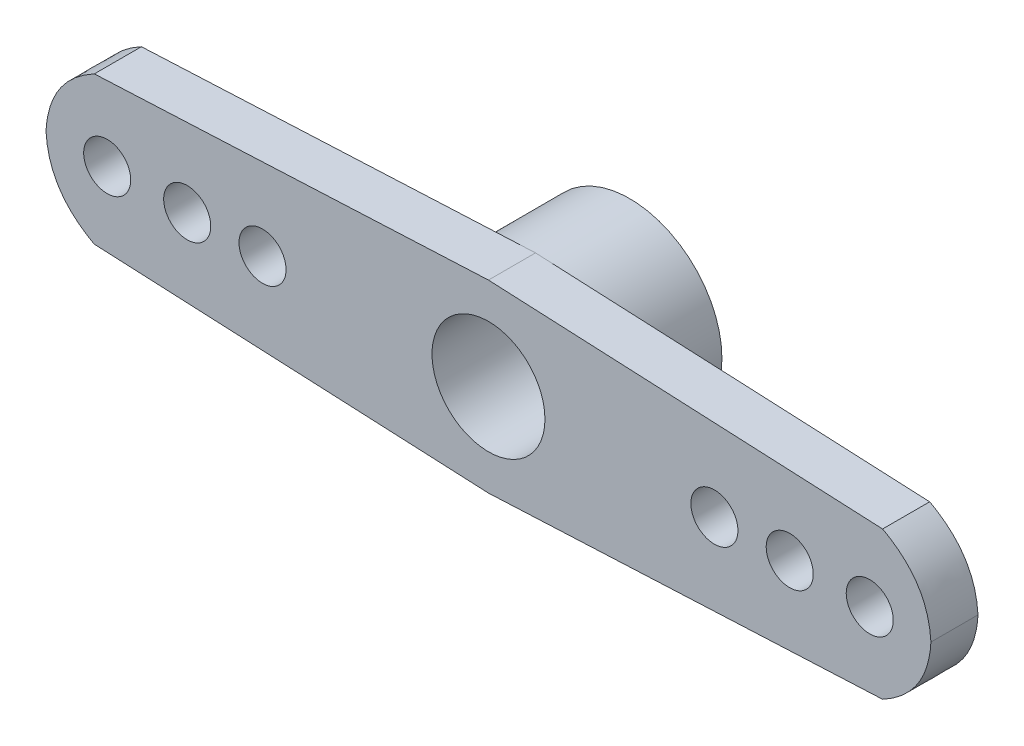
ISO-10303-21;
HEADER;
FILE_DESCRIPTION(('STEP AP214'),'2;1');
FILE_NAME('part.step','',(''),(''),'','','');
FILE_SCHEMA(('AUTOMOTIVE_DESIGN { 1 0 10303 214 1 1 1 1 }'));
ENDSEC;
DATA;
#1=APPLICATION_CONTEXT('core data for automotive mechanical design processes');
#2=APPLICATION_PROTOCOL_DEFINITION('international standard','automotive_design',2000,#1);
#3=PRODUCT_CONTEXT('',#1,'mechanical');
#4=PRODUCT('Part','Part','',(#3));
#5=PRODUCT_RELATED_PRODUCT_CATEGORY('part','',(#4));
#6=PRODUCT_DEFINITION_FORMATION('','',#4);
#7=PRODUCT_DEFINITION_CONTEXT('part definition',#1,'design');
#8=PRODUCT_DEFINITION('design','',#6,#7);
#9=PRODUCT_DEFINITION_SHAPE('','',#8);
#10=(LENGTH_UNIT() NAMED_UNIT(*) SI_UNIT(.MILLI.,.METRE.));
#11=(NAMED_UNIT(*) PLANE_ANGLE_UNIT() SI_UNIT($,.RADIAN.));
#12=(NAMED_UNIT(*) SI_UNIT($,.STERADIAN.) SOLID_ANGLE_UNIT());
#13=UNCERTAINTY_MEASURE_WITH_UNIT(LENGTH_MEASURE(1.E-05),#10,'distance_accuracy_value','');
#14=(GEOMETRIC_REPRESENTATION_CONTEXT(3) GLOBAL_UNCERTAINTY_ASSIGNED_CONTEXT((#13)) GLOBAL_UNIT_ASSIGNED_CONTEXT((#10,
#11,#12)) REPRESENTATION_CONTEXT('',''));
#15=CARTESIAN_POINT('',(0.,0.,0.));
#16=DIRECTION('',(0.,0.,1.));
#17=DIRECTION('',(1.,0.,0.));
#18=AXIS2_PLACEMENT_3D('',#15,#16,#17);
#19=CARTESIAN_POINT('',(0.,0.,5.));
#20=DIRECTION('',(0.,0.,-1.));
#21=DIRECTION('',(-1.,0.,0.));
#22=AXIS2_PLACEMENT_3D('',#19,#20,#21);
#23=CYLINDRICAL_SURFACE('',#22,4.9);
#24=CARTESIAN_POINT('',(0.45908660855378,4.87844642133606,5.));
#25=DIRECTION('',(-0.998899722313693,0.0468971722135448,0.));
#26=VECTOR('',#25,1.);
#27=LINE('',#24,#26);
#28=CARTESIAN_POINT('',(0.45908660855378,4.87844642133606,5.));
#29=VERTEX_POINT('',#28);
#30=CARTESIAN_POINT('',(0.,4.9,5.));
#31=VERTEX_POINT('',#30);
#32=EDGE_CURVE('E13',#29,#31,#27,.T.);
#33=ORIENTED_EDGE('',*,*,#32,.F.);
#34=CARTESIAN_POINT('',(0.,0.,5.));
#35=DIRECTION('',(0.,0.,1.));
#36=DIRECTION('',(1.,0.,0.));
#37=AXIS2_PLACEMENT_3D('',#34,#35,#36);
#38=CIRCLE('',#37,4.9);
#39=CARTESIAN_POINT('',(0.45908660855378,-4.87844642133606,5.));
#40=VERTEX_POINT('',#39);
#41=EDGE_CURVE('E63',#40,#29,#38,.T.);
#42=ORIENTED_EDGE('',*,*,#41,.F.);
#43=CARTESIAN_POINT('',(0.,-4.9,5.));
#44=DIRECTION('',(0.998899722313693,0.0468971722135448,0.));
#45=VECTOR('',#44,1.);
#46=LINE('',#43,#45);
#47=CARTESIAN_POINT('',(0.,-4.9,5.));
#48=VERTEX_POINT('',#47);
#49=EDGE_CURVE('E369',#48,#40,#46,.T.);
#50=ORIENTED_EDGE('',*,*,#49,.F.);
#51=CARTESIAN_POINT('',(-0.45908660855378,-4.87844642133606,5.));
#52=DIRECTION('',(0.998899722313693,-0.0468971722135448,0.));
#53=VECTOR('',#52,1.);
#54=LINE('',#51,#53);
#55=CARTESIAN_POINT('',(-0.45908660855378,-4.87844642133606,5.));
#56=VERTEX_POINT('',#55);
#57=EDGE_CURVE('E56',#56,#48,#54,.T.);
#58=ORIENTED_EDGE('',*,*,#57,.F.);
#59=CARTESIAN_POINT('',(-0.45908660855378,4.87844642133606,5.));
#60=VERTEX_POINT('',#59);
#61=EDGE_CURVE('E270',#60,#56,#38,.T.);
#62=ORIENTED_EDGE('',*,*,#61,.F.);
#63=CARTESIAN_POINT('',(0.,4.9,5.));
#64=DIRECTION('',(-0.998899722313693,-0.0468971722135448,0.));
#65=VECTOR('',#64,1.);
#66=LINE('',#63,#65);
#67=EDGE_CURVE('E251',#31,#60,#66,.T.);
#68=ORIENTED_EDGE('',*,*,#67,.F.);
#69=EDGE_LOOP('',(#33,#42,#50,#58,#62,#68));
#70=FACE_BOUND('',#69,.T.);
#71=CARTESIAN_POINT('',(0.,0.,0.));
#72=DIRECTION('',(0.,0.,1.));
#73=DIRECTION('',(1.,0.,0.));
#74=AXIS2_PLACEMENT_3D('',#71,#72,#73);
#75=CIRCLE('',#74,4.9);
#76=CARTESIAN_POINT('',(4.9,0.,0.));
#77=VERTEX_POINT('',#76);
#78=EDGE_CURVE('E154',#77,#77,#75,.T.);
#79=ORIENTED_EDGE('',*,*,#78,.T.);
#80=EDGE_LOOP('',(#79));
#81=FACE_BOUND('',#80,.T.);
#82=ADVANCED_FACE('F46',(#70,#81),#23,.T.);
#83=CARTESIAN_POINT('',(0.,0.,0.));
#84=DIRECTION('',(0.,0.,1.));
#85=DIRECTION('',(1.,0.,0.));
#86=AXIS2_PLACEMENT_3D('',#83,#84,#85);
#87=PLANE('',#86);
#88=CARTESIAN_POINT('',(0.,0.,0.));
#89=DIRECTION('',(0.,0.,1.));
#90=DIRECTION('',(1.,0.,0.));
#91=AXIS2_PLACEMENT_3D('',#88,#89,#90);
#92=CIRCLE('',#91,3.);
#93=CARTESIAN_POINT('',(3.,0.,0.));
#94=VERTEX_POINT('',#93);
#95=EDGE_CURVE('E151',#94,#94,#92,.T.);
#96=ORIENTED_EDGE('',*,*,#95,.T.);
#97=EDGE_LOOP('',(#96));
#98=FACE_BOUND('',#97,.T.);
#99=ORIENTED_EDGE('',*,*,#78,.F.);
#100=EDGE_LOOP('',(#99));
#101=FACE_BOUND('',#100,.T.);
#102=ADVANCED_FACE('F286',(#98,#101),#87,.F.);
#103=CARTESIAN_POINT('',(0.,0.,0.));
#104=DIRECTION('',(0.,0.,1.));
#105=DIRECTION('',(1.,0.,0.));
#106=AXIS2_PLACEMENT_3D('',#103,#104,#105);
#107=CYLINDRICAL_SURFACE('',#106,3.);
#108=ORIENTED_EDGE('',*,*,#95,.F.);
#109=EDGE_LOOP('',(#108));
#110=FACE_BOUND('',#109,.T.);
#111=CARTESIAN_POINT('',(0.,0.,7.5));
#112=DIRECTION('',(0.,0.,1.));
#113=DIRECTION('',(1.,0.,0.));
#114=AXIS2_PLACEMENT_3D('',#111,#112,#113);
#115=CIRCLE('',#114,3.);
#116=CARTESIAN_POINT('',(3.,0.,7.5));
#117=VERTEX_POINT('',#116);
#118=EDGE_CURVE('E299',#117,#117,#115,.T.);
#119=ORIENTED_EDGE('',*,*,#118,.T.);
#120=EDGE_LOOP('',(#119));
#121=FACE_BOUND('',#120,.T.);
#122=ADVANCED_FACE('F182',(#110,#121),#107,.F.);
#123=CARTESIAN_POINT('',(-22.7863167915402,-2.28881966851325,5.));
#124=DIRECTION('',(0.,0.,1.));
#125=DIRECTION('',(1.,0.,0.));
#126=AXIS2_PLACEMENT_3D('',#123,#124,#125);
#127=PLANE('',#126);
#128=CARTESIAN_POINT('',(-12.,0.,5.));
#129=DIRECTION('',(0.,0.,1.));
#130=DIRECTION('',(1.,0.,0.));
#131=AXIS2_PLACEMENT_3D('',#128,#129,#130);
#132=CIRCLE('',#131,1.25);
#133=CARTESIAN_POINT('',(-10.75,0.,5.));
#134=VERTEX_POINT('',#133);
#135=EDGE_CURVE('E301',#134,#134,#132,.T.);
#136=ORIENTED_EDGE('',*,*,#135,.T.);
#137=EDGE_LOOP('',(#136));
#138=FACE_BOUND('',#137,.T.);
#139=CARTESIAN_POINT('',(-16.,0.,5.));
#140=DIRECTION('',(0.,0.,1.));
#141=DIRECTION('',(1.,0.,0.));
#142=AXIS2_PLACEMENT_3D('',#139,#140,#141);
#143=CIRCLE('',#142,1.25);
#144=CARTESIAN_POINT('',(-14.75,0.,5.));
#145=VERTEX_POINT('',#144);
#146=EDGE_CURVE('E313',#145,#145,#143,.T.);
#147=ORIENTED_EDGE('',*,*,#146,.T.);
#148=EDGE_LOOP('',(#147));
#149=FACE_BOUND('',#148,.T.);
#150=CARTESIAN_POINT('',(-20.25,0.,5.));
#151=DIRECTION('',(0.,0.,1.));
#152=DIRECTION('',(1.,0.,0.));
#153=AXIS2_PLACEMENT_3D('',#150,#151,#152);
#154=CIRCLE('',#153,1.25);
#155=CARTESIAN_POINT('',(-19.,0.,5.));
#156=VERTEX_POINT('',#155);
#157=EDGE_CURVE('E187',#156,#156,#154,.T.);
#158=ORIENTED_EDGE('',*,*,#157,.T.);
#159=EDGE_LOOP('',(#158));
#160=FACE_BOUND('',#159,.T.);
#161=DIRECTION('',(-0.998899722313693,-0.046897172213544,0.));
#162=VECTOR('',#161,1.);
#163=CARTESIAN_POINT('',(0.,4.9,5.));
#164=LINE('',#163,#162);
#165=CARTESIAN_POINT('',(-20.9326924063467,3.91723460449086,5.));
#166=VERTEX_POINT('',#165);
#167=EDGE_CURVE('E237',#60,#166,#164,.T.);
#168=ORIENTED_EDGE('',*,*,#167,.F.);
#169=ORIENTED_EDGE('',*,*,#61,.T.);
#170=DIRECTION('',(0.998899722313693,-0.046897172213544,0.));
#171=VECTOR('',#170,1.);
#172=CARTESIAN_POINT('',(0.,-4.9,5.));
#173=LINE('',#172,#171);
#174=CARTESIAN_POINT('',(-20.9326924063467,-3.91723460449086,5.));
#175=VERTEX_POINT('',#174);
#176=EDGE_CURVE('E166',#175,#56,#173,.T.);
#177=ORIENTED_EDGE('',*,*,#176,.F.);
#178=CARTESIAN_POINT('',(-23.5,0.,5.));
#179=CARTESIAN_POINT('',(-23.356287379907,-2.61902203478107,5.));
#180=CARTESIAN_POINT('',(-20.9326924063467,-3.91723460449086,5.));
#181=B_SPLINE_CURVE_WITH_KNOTS('',2,(#178,#179,#180),.UNSPECIFIED.,.F.,.F.,(3,3),(0.,1.),.UNSPECIFIED.);
#182=CARTESIAN_POINT('',(-23.5,0.,5.));
#183=VERTEX_POINT('',#182);
#184=EDGE_CURVE('E150',#183,#175,#181,.T.);
#185=ORIENTED_EDGE('',*,*,#184,.F.);
#186=CARTESIAN_POINT('',(-20.9326924063467,3.91723460449086,5.));
#187=CARTESIAN_POINT('',(-23.356287379907,2.61902203478107,5.));
#188=CARTESIAN_POINT('',(-23.5,0.,5.));
#189=B_SPLINE_CURVE_WITH_KNOTS('',2,(#186,#187,#188),.UNSPECIFIED.,.F.,.F.,(3,3),(0.,1.),.UNSPECIFIED.);
#190=EDGE_CURVE('E146',#166,#183,#189,.T.);
#191=ORIENTED_EDGE('',*,*,#190,.F.);
#192=EDGE_LOOP('',(#168,#169,#177,#185,#191));
#193=FACE_BOUND('',#192,.T.);
#194=ADVANCED_FACE('F293',(#138,#149,#160,#193),#127,.F.);
#195=CARTESIAN_POINT('',(20.25,0.,5.));
#196=DIRECTION('',(0.,0.,1.));
#197=DIRECTION('',(-1.,0.,0.));
#198=AXIS2_PLACEMENT_3D('',#195,#196,#197);
#199=CIRCLE('',#198,1.25);
#200=CARTESIAN_POINT('',(19.,0.,5.));
#201=VERTEX_POINT('',#200);
#202=EDGE_CURVE('E488',#201,#201,#199,.T.);
#203=ORIENTED_EDGE('',*,*,#202,.T.);
#204=EDGE_LOOP('',(#203));
#205=FACE_BOUND('',#204,.T.);
#206=CARTESIAN_POINT('',(16.,0.,5.));
#207=DIRECTION('',(0.,0.,1.));
#208=DIRECTION('',(-1.,0.,0.));
#209=AXIS2_PLACEMENT_3D('',#206,#207,#208);
#210=CIRCLE('',#209,1.25);
#211=CARTESIAN_POINT('',(14.75,0.,5.));
#212=VERTEX_POINT('',#211);
#213=EDGE_CURVE('E491',#212,#212,#210,.T.);
#214=ORIENTED_EDGE('',*,*,#213,.T.);
#215=EDGE_LOOP('',(#214));
#216=FACE_BOUND('',#215,.T.);
#217=CARTESIAN_POINT('',(12.,0.,5.));
#218=DIRECTION('',(0.,0.,1.));
#219=DIRECTION('',(-1.,0.,0.));
#220=AXIS2_PLACEMENT_3D('',#217,#218,#219);
#221=CIRCLE('',#220,1.25);
#222=CARTESIAN_POINT('',(10.75,0.,5.));
#223=VERTEX_POINT('',#222);
#224=EDGE_CURVE('E308',#223,#223,#221,.T.);
#225=ORIENTED_EDGE('',*,*,#224,.T.);
#226=EDGE_LOOP('',(#225));
#227=FACE_BOUND('',#226,.T.);
#228=DIRECTION('',(0.998899722313693,0.046897172213544,0.));
#229=VECTOR('',#228,1.);
#230=CARTESIAN_POINT('',(0.,-4.9,5.));
#231=LINE('',#230,#229);
#232=CARTESIAN_POINT('',(20.9326924063467,-3.91723460449087,5.));
#233=VERTEX_POINT('',#232);
#234=EDGE_CURVE('E399',#40,#233,#231,.T.);
#235=ORIENTED_EDGE('',*,*,#234,.F.);
#236=ORIENTED_EDGE('',*,*,#41,.T.);
#237=DIRECTION('',(-0.998899722313693,0.046897172213544,0.));
#238=VECTOR('',#237,1.);
#239=CARTESIAN_POINT('',(0.,4.9,5.));
#240=LINE('',#239,#238);
#241=CARTESIAN_POINT('',(20.9326924063467,3.91723460449086,5.));
#242=VERTEX_POINT('',#241);
#243=EDGE_CURVE('E229',#242,#29,#240,.T.);
#244=ORIENTED_EDGE('',*,*,#243,.F.);
#245=CARTESIAN_POINT('',(23.5,0.,5.));
#246=CARTESIAN_POINT('',(23.356287379907,2.61902203478108,5.));
#247=CARTESIAN_POINT('',(20.9326924063467,3.91723460449087,5.));
#248=B_SPLINE_CURVE_WITH_KNOTS('',2,(#245,#246,#247),.UNSPECIFIED.,.F.,.F.,(3,3),(0.,1.),.UNSPECIFIED.);
#249=CARTESIAN_POINT('',(23.5,0.,5.));
#250=VERTEX_POINT('',#249);
#251=EDGE_CURVE('E238',#250,#242,#248,.T.);
#252=ORIENTED_EDGE('',*,*,#251,.F.);
#253=CARTESIAN_POINT('',(20.9326924063467,-3.91723460449087,5.));
#254=CARTESIAN_POINT('',(23.356287379907,-2.61902203478107,5.));
#255=CARTESIAN_POINT('',(23.5,0.,5.));
#256=B_SPLINE_CURVE_WITH_KNOTS('',2,(#253,#254,#255),.UNSPECIFIED.,.F.,.F.,(3,3),(0.,1.),.UNSPECIFIED.);
#257=EDGE_CURVE('E362',#233,#250,#256,.T.);
#258=ORIENTED_EDGE('',*,*,#257,.F.);
#259=EDGE_LOOP('',(#235,#236,#244,#252,#258));
#260=FACE_BOUND('',#259,.T.);
#261=ADVANCED_FACE('F345',(#205,#216,#227,#260),#127,.F.);
#262=CARTESIAN_POINT('',(-22.7863167915402,-2.28881966851325,7.5));
#263=DIRECTION('',(0.,0.,1.));
#264=DIRECTION('',(1.,0.,0.));
#265=AXIS2_PLACEMENT_3D('',#262,#263,#264);
#266=PLANE('',#265);
#267=CARTESIAN_POINT('',(16.,0.,7.5));
#268=DIRECTION('',(0.,0.,1.));
#269=DIRECTION('',(-1.,0.,0.));
#270=AXIS2_PLACEMENT_3D('',#267,#268,#269);
#271=CIRCLE('',#270,1.25);
#272=CARTESIAN_POINT('',(14.75,0.,7.5));
#273=VERTEX_POINT('',#272);
#274=EDGE_CURVE('E494',#273,#273,#271,.T.);
#275=ORIENTED_EDGE('',*,*,#274,.F.);
#276=EDGE_LOOP('',(#275));
#277=FACE_BOUND('',#276,.T.);
#278=ORIENTED_EDGE('',*,*,#118,.F.);
#279=EDGE_LOOP('',(#278));
#280=FACE_BOUND('',#279,.T.);
#281=CARTESIAN_POINT('',(-16.,0.,7.5));
#282=DIRECTION('',(0.,0.,1.));
#283=DIRECTION('',(1.,0.,0.));
#284=AXIS2_PLACEMENT_3D('',#281,#282,#283);
#285=CIRCLE('',#284,1.25);
#286=CARTESIAN_POINT('',(-14.75,0.,7.5));
#287=VERTEX_POINT('',#286);
#288=EDGE_CURVE('E315',#287,#287,#285,.T.);
#289=ORIENTED_EDGE('',*,*,#288,.F.);
#290=EDGE_LOOP('',(#289));
#291=FACE_BOUND('',#290,.T.);
#292=CARTESIAN_POINT('',(-23.5,0.,7.5));
#293=CARTESIAN_POINT('',(-23.356287379907,-2.61902203478107,7.5));
#294=CARTESIAN_POINT('',(-20.9326924063467,-3.91723460449086,7.5));
#295=B_SPLINE_CURVE_WITH_KNOTS('',2,(#292,#293,#294),.UNSPECIFIED.,.F.,.F.,(3,3),(0.,1.),.UNSPECIFIED.);
#296=CARTESIAN_POINT('',(-23.5,0.,7.5));
#297=VERTEX_POINT('',#296);
#298=CARTESIAN_POINT('',(-20.9326924063467,-3.91723460449086,7.5));
#299=VERTEX_POINT('',#298);
#300=EDGE_CURVE('E136',#297,#299,#295,.T.);
#301=ORIENTED_EDGE('',*,*,#300,.T.);
#302=DIRECTION('',(0.998899722313693,-0.046897172213544,0.));
#303=VECTOR('',#302,1.);
#304=CARTESIAN_POINT('',(0.,-4.9,7.5));
#305=LINE('',#304,#303);
#306=CARTESIAN_POINT('',(0.,-4.9,7.5));
#307=VERTEX_POINT('',#306);
#308=EDGE_CURVE('E124',#299,#307,#305,.T.);
#309=ORIENTED_EDGE('',*,*,#308,.T.);
#310=DIRECTION('',(0.998899722313693,0.046897172213544,0.));
#311=VECTOR('',#310,1.);
#312=CARTESIAN_POINT('',(0.,-4.9,7.5));
#313=LINE('',#312,#311);
#314=CARTESIAN_POINT('',(20.9326924063467,-3.91723460449087,7.5));
#315=VERTEX_POINT('',#314);
#316=EDGE_CURVE('E135',#307,#315,#313,.T.);
#317=ORIENTED_EDGE('',*,*,#316,.T.);
#318=CARTESIAN_POINT('',(20.9326924063467,-3.91723460449087,7.5));
#319=CARTESIAN_POINT('',(23.356287379907,-2.61902203478107,7.5));
#320=CARTESIAN_POINT('',(23.5,0.,7.5));
#321=B_SPLINE_CURVE_WITH_KNOTS('',2,(#318,#319,#320),.UNSPECIFIED.,.F.,.F.,(3,3),(0.,1.),.UNSPECIFIED.);
#322=CARTESIAN_POINT('',(23.5,0.,7.5));
#323=VERTEX_POINT('',#322);
#324=EDGE_CURVE('E194',#315,#323,#321,.T.);
#325=ORIENTED_EDGE('',*,*,#324,.T.);
#326=CARTESIAN_POINT('',(23.5,0.,7.5));
#327=CARTESIAN_POINT('',(23.356287379907,2.61902203478108,7.5));
#328=CARTESIAN_POINT('',(20.9326924063467,3.91723460449087,7.5));
#329=B_SPLINE_CURVE_WITH_KNOTS('',2,(#326,#327,#328),.UNSPECIFIED.,.F.,.F.,(3,3),(0.,1.),.UNSPECIFIED.);
#330=CARTESIAN_POINT('',(20.9326924063467,3.91723460449086,7.5));
#331=VERTEX_POINT('',#330);
#332=EDGE_CURVE('E199',#323,#331,#329,.T.);
#333=ORIENTED_EDGE('',*,*,#332,.T.);
#334=DIRECTION('',(-0.998899722313693,0.046897172213544,0.));
#335=VECTOR('',#334,1.);
#336=CARTESIAN_POINT('',(0.,4.9,7.5));
#337=LINE('',#336,#335);
#338=CARTESIAN_POINT('',(0.,4.9,7.5));
#339=VERTEX_POINT('',#338);
#340=EDGE_CURVE('E404',#331,#339,#337,.T.);
#341=ORIENTED_EDGE('',*,*,#340,.T.);
#342=DIRECTION('',(-0.998899722313693,-0.046897172213544,0.));
#343=VECTOR('',#342,1.);
#344=CARTESIAN_POINT('',(0.,4.9,7.5));
#345=LINE('',#344,#343);
#346=CARTESIAN_POINT('',(-20.9326924063467,3.91723460449086,7.5));
#347=VERTEX_POINT('',#346);
#348=EDGE_CURVE('E355',#339,#347,#345,.T.);
#349=ORIENTED_EDGE('',*,*,#348,.T.);
#350=CARTESIAN_POINT('',(-20.9326924063467,3.91723460449086,7.5));
#351=CARTESIAN_POINT('',(-23.356287379907,2.61902203478107,7.5));
#352=CARTESIAN_POINT('',(-23.5,0.,7.5));
#353=B_SPLINE_CURVE_WITH_KNOTS('',2,(#350,#351,#352),.UNSPECIFIED.,.F.,.F.,(3,3),(0.,1.),.UNSPECIFIED.);
#354=EDGE_CURVE('E142',#347,#297,#353,.T.);
#355=ORIENTED_EDGE('',*,*,#354,.T.);
#356=EDGE_LOOP('',(#301,#309,#317,#325,#333,#341,#349,#355));
#357=FACE_BOUND('',#356,.T.);
#358=CARTESIAN_POINT('',(-20.25,0.,7.5));
#359=DIRECTION('',(0.,0.,1.));
#360=DIRECTION('',(1.,0.,0.));
#361=AXIS2_PLACEMENT_3D('',#358,#359,#360);
#362=CIRCLE('',#361,1.25);
#363=CARTESIAN_POINT('',(-19.,0.,7.5));
#364=VERTEX_POINT('',#363);
#365=EDGE_CURVE('E319',#364,#364,#362,.T.);
#366=ORIENTED_EDGE('',*,*,#365,.F.);
#367=EDGE_LOOP('',(#366));
#368=FACE_BOUND('',#367,.T.);
#369=CARTESIAN_POINT('',(-12.,0.,7.5));
#370=DIRECTION('',(0.,0.,1.));
#371=DIRECTION('',(1.,0.,0.));
#372=AXIS2_PLACEMENT_3D('',#369,#370,#371);
#373=CIRCLE('',#372,1.25);
#374=CARTESIAN_POINT('',(-10.75,0.,7.5));
#375=VERTEX_POINT('',#374);
#376=EDGE_CURVE('E305',#375,#375,#373,.T.);
#377=ORIENTED_EDGE('',*,*,#376,.F.);
#378=EDGE_LOOP('',(#377));
#379=FACE_BOUND('',#378,.T.);
#380=CARTESIAN_POINT('',(12.,0.,7.5));
#381=DIRECTION('',(0.,0.,1.));
#382=DIRECTION('',(-1.,0.,0.));
#383=AXIS2_PLACEMENT_3D('',#380,#381,#382);
#384=CIRCLE('',#383,1.25);
#385=CARTESIAN_POINT('',(10.75,0.,7.5));
#386=VERTEX_POINT('',#385);
#387=EDGE_CURVE('E302',#386,#386,#384,.T.);
#388=ORIENTED_EDGE('',*,*,#387,.F.);
#389=EDGE_LOOP('',(#388));
#390=FACE_BOUND('',#389,.T.);
#391=CARTESIAN_POINT('',(20.25,0.,7.5));
#392=DIRECTION('',(0.,0.,1.));
#393=DIRECTION('',(-1.,0.,0.));
#394=AXIS2_PLACEMENT_3D('',#391,#392,#393);
#395=CIRCLE('',#394,1.25);
#396=CARTESIAN_POINT('',(19.,0.,7.5));
#397=VERTEX_POINT('',#396);
#398=EDGE_CURVE('E485',#397,#397,#395,.T.);
#399=ORIENTED_EDGE('',*,*,#398,.F.);
#400=EDGE_LOOP('',(#399));
#401=FACE_BOUND('',#400,.T.);
#402=ADVANCED_FACE('F139',(#277,#280,#291,#357,#368,#379,#390,#401),#266,.T.);
#403=DIRECTION('',(0.,0.,-1.));
#404=VECTOR('',#403,1.);
#405=SURFACE_OF_LINEAR_EXTRUSION('',#295,#404);
#406=ORIENTED_EDGE('',*,*,#184,.T.);
#407=DIRECTION('',(0.,0.,-1.));
#408=VECTOR('',#407,1.);
#409=CARTESIAN_POINT('',(-20.9326924063467,-3.91723460449086,7.5));
#410=LINE('',#409,#408);
#411=EDGE_CURVE('E129',#299,#175,#410,.T.);
#412=ORIENTED_EDGE('',*,*,#411,.F.);
#413=ORIENTED_EDGE('',*,*,#300,.F.);
#414=DIRECTION('',(0.,0.,-1.));
#415=VECTOR('',#414,1.);
#416=CARTESIAN_POINT('',(-23.5,0.,7.5));
#417=LINE('',#416,#415);
#418=EDGE_CURVE('E354',#297,#183,#417,.T.);
#419=ORIENTED_EDGE('',*,*,#418,.T.);
#420=EDGE_LOOP('',(#406,#412,#413,#419));
#421=FACE_BOUND('',#420,.T.);
#422=ADVANCED_FACE('F148',(#421),#405,.F.);
#423=CARTESIAN_POINT('',(0.,-4.9,7.5));
#424=DIRECTION('',(0.046897172213544,0.998899722313693,0.));
#425=DIRECTION('',(-0.998899722313693,0.046897172213544,0.));
#426=AXIS2_PLACEMENT_3D('',#423,#424,#425);
#427=PLANE('',#426);
#428=ORIENTED_EDGE('',*,*,#176,.T.);
#429=ORIENTED_EDGE('',*,*,#57,.T.);
#430=DIRECTION('',(0.,0.,-1.));
#431=VECTOR('',#430,1.);
#432=CARTESIAN_POINT('',(0.,-4.9,7.5));
#433=LINE('',#432,#431);
#434=EDGE_CURVE('E132',#307,#48,#433,.T.);
#435=ORIENTED_EDGE('',*,*,#434,.F.);
#436=ORIENTED_EDGE('',*,*,#308,.F.);
#437=ORIENTED_EDGE('',*,*,#411,.T.);
#438=EDGE_LOOP('',(#428,#429,#435,#436,#437));
#439=FACE_BOUND('',#438,.T.);
#440=ADVANCED_FACE('F127',(#439),#427,.F.);
#441=CARTESIAN_POINT('',(0.,-4.9,7.5));
#442=DIRECTION('',(-0.046897172213544,0.998899722313693,0.));
#443=DIRECTION('',(-0.998899722313693,-0.046897172213544,0.));
#444=AXIS2_PLACEMENT_3D('',#441,#442,#443);
#445=PLANE('',#444);
#446=ORIENTED_EDGE('',*,*,#49,.T.);
#447=ORIENTED_EDGE('',*,*,#234,.T.);
#448=DIRECTION('',(0.,0.,-1.));
#449=VECTOR('',#448,1.);
#450=CARTESIAN_POINT('',(20.9326924063467,-3.91723460449087,7.5));
#451=LINE('',#450,#449);
#452=EDGE_CURVE('E156',#315,#233,#451,.T.);
#453=ORIENTED_EDGE('',*,*,#452,.F.);
#454=ORIENTED_EDGE('',*,*,#316,.F.);
#455=ORIENTED_EDGE('',*,*,#434,.T.);
#456=EDGE_LOOP('',(#446,#447,#453,#454,#455));
#457=FACE_BOUND('',#456,.T.);
#458=ADVANCED_FACE('F177',(#457),#445,.F.);
#459=DIRECTION('',(0.,0.,-1.));
#460=VECTOR('',#459,1.);
#461=SURFACE_OF_LINEAR_EXTRUSION('',#321,#460);
#462=ORIENTED_EDGE('',*,*,#257,.T.);
#463=DIRECTION('',(0.,0.,-1.));
#464=VECTOR('',#463,1.);
#465=CARTESIAN_POINT('',(23.5,0.,7.5));
#466=LINE('',#465,#464);
#467=EDGE_CURVE('E389',#323,#250,#466,.T.);
#468=ORIENTED_EDGE('',*,*,#467,.F.);
#469=ORIENTED_EDGE('',*,*,#324,.F.);
#470=ORIENTED_EDGE('',*,*,#452,.T.);
#471=EDGE_LOOP('',(#462,#468,#469,#470));
#472=FACE_BOUND('',#471,.T.);
#473=ADVANCED_FACE('F207',(#472),#461,.F.);
#474=DIRECTION('',(0.,0.,-1.));
#475=VECTOR('',#474,1.);
#476=SURFACE_OF_LINEAR_EXTRUSION('',#329,#475);
#477=ORIENTED_EDGE('',*,*,#251,.T.);
#478=DIRECTION('',(0.,0.,-1.));
#479=VECTOR('',#478,1.);
#480=CARTESIAN_POINT('',(20.9326924063467,3.91723460449086,7.5));
#481=LINE('',#480,#479);
#482=EDGE_CURVE('E244',#331,#242,#481,.T.);
#483=ORIENTED_EDGE('',*,*,#482,.F.);
#484=ORIENTED_EDGE('',*,*,#332,.F.);
#485=ORIENTED_EDGE('',*,*,#467,.T.);
#486=EDGE_LOOP('',(#477,#483,#484,#485));
#487=FACE_BOUND('',#486,.T.);
#488=ADVANCED_FACE('F210',(#487),#476,.F.);
#489=CARTESIAN_POINT('',(0.,4.9,7.5));
#490=DIRECTION('',(-0.046897172213544,-0.998899722313693,0.));
#491=DIRECTION('',(0.998899722313693,-0.046897172213544,0.));
#492=AXIS2_PLACEMENT_3D('',#489,#490,#491);
#493=PLANE('',#492);
#494=ORIENTED_EDGE('',*,*,#243,.T.);
#495=ORIENTED_EDGE('',*,*,#32,.T.);
#496=DIRECTION('',(0.,0.,-1.));
#497=VECTOR('',#496,1.);
#498=CARTESIAN_POINT('',(0.,4.9,7.5));
#499=LINE('',#498,#497);
#500=EDGE_CURVE('E241',#339,#31,#499,.T.);
#501=ORIENTED_EDGE('',*,*,#500,.F.);
#502=ORIENTED_EDGE('',*,*,#340,.F.);
#503=ORIENTED_EDGE('',*,*,#482,.T.);
#504=EDGE_LOOP('',(#494,#495,#501,#502,#503));
#505=FACE_BOUND('',#504,.T.);
#506=ADVANCED_FACE('F214',(#505),#493,.F.);
#507=CARTESIAN_POINT('',(0.,4.9,7.5));
#508=DIRECTION('',(0.046897172213544,-0.998899722313693,0.));
#509=DIRECTION('',(0.998899722313693,0.046897172213544,0.));
#510=AXIS2_PLACEMENT_3D('',#507,#508,#509);
#511=PLANE('',#510);
#512=ORIENTED_EDGE('',*,*,#67,.T.);
#513=ORIENTED_EDGE('',*,*,#167,.T.);
#514=DIRECTION('',(0.,0.,-1.));
#515=VECTOR('',#514,1.);
#516=CARTESIAN_POINT('',(-20.9326924063467,3.91723460449086,7.5));
#517=LINE('',#516,#515);
#518=EDGE_CURVE('E245',#347,#166,#517,.T.);
#519=ORIENTED_EDGE('',*,*,#518,.F.);
#520=ORIENTED_EDGE('',*,*,#348,.F.);
#521=ORIENTED_EDGE('',*,*,#500,.T.);
#522=EDGE_LOOP('',(#512,#513,#519,#520,#521));
#523=FACE_BOUND('',#522,.T.);
#524=ADVANCED_FACE('F219',(#523),#511,.F.);
#525=DIRECTION('',(0.,0.,-1.));
#526=VECTOR('',#525,1.);
#527=SURFACE_OF_LINEAR_EXTRUSION('',#353,#526);
#528=ORIENTED_EDGE('',*,*,#190,.T.);
#529=ORIENTED_EDGE('',*,*,#418,.F.);
#530=ORIENTED_EDGE('',*,*,#354,.F.);
#531=ORIENTED_EDGE('',*,*,#518,.T.);
#532=EDGE_LOOP('',(#528,#529,#530,#531));
#533=FACE_BOUND('',#532,.T.);
#534=ADVANCED_FACE('F331',(#533),#527,.F.);
#535=CARTESIAN_POINT('',(-20.25,0.,7.5));
#536=DIRECTION('',(0.,0.,-1.));
#537=DIRECTION('',(-1.,0.,0.));
#538=AXIS2_PLACEMENT_3D('',#535,#536,#537);
#539=CYLINDRICAL_SURFACE('',#538,1.25);
#540=ORIENTED_EDGE('',*,*,#365,.T.);
#541=EDGE_LOOP('',(#540));
#542=FACE_BOUND('',#541,.T.);
#543=ORIENTED_EDGE('',*,*,#157,.F.);
#544=EDGE_LOOP('',(#543));
#545=FACE_BOUND('',#544,.T.);
#546=ADVANCED_FACE('F328',(#542,#545),#539,.F.);
#547=CARTESIAN_POINT('',(-16.,0.,7.5));
#548=DIRECTION('',(0.,0.,-1.));
#549=DIRECTION('',(-1.,0.,0.));
#550=AXIS2_PLACEMENT_3D('',#547,#548,#549);
#551=CYLINDRICAL_SURFACE('',#550,1.25);
#552=ORIENTED_EDGE('',*,*,#288,.T.);
#553=EDGE_LOOP('',(#552));
#554=FACE_BOUND('',#553,.T.);
#555=ORIENTED_EDGE('',*,*,#146,.F.);
#556=EDGE_LOOP('',(#555));
#557=FACE_BOUND('',#556,.T.);
#558=ADVANCED_FACE('F330',(#554,#557),#551,.F.);
#559=CARTESIAN_POINT('',(-12.,0.,7.5));
#560=DIRECTION('',(0.,0.,-1.));
#561=DIRECTION('',(-1.,0.,0.));
#562=AXIS2_PLACEMENT_3D('',#559,#560,#561);
#563=CYLINDRICAL_SURFACE('',#562,1.25);
#564=ORIENTED_EDGE('',*,*,#376,.T.);
#565=EDGE_LOOP('',(#564));
#566=FACE_BOUND('',#565,.T.);
#567=ORIENTED_EDGE('',*,*,#135,.F.);
#568=EDGE_LOOP('',(#567));
#569=FACE_BOUND('',#568,.T.);
#570=ADVANCED_FACE('F337',(#566,#569),#563,.F.);
#571=CARTESIAN_POINT('',(12.,0.,7.5));
#572=DIRECTION('',(0.,0.,-1.));
#573=DIRECTION('',(-1.,0.,0.));
#574=AXIS2_PLACEMENT_3D('',#571,#572,#573);
#575=CYLINDRICAL_SURFACE('',#574,1.25);
#576=ORIENTED_EDGE('',*,*,#387,.T.);
#577=EDGE_LOOP('',(#576));
#578=FACE_BOUND('',#577,.T.);
#579=ORIENTED_EDGE('',*,*,#224,.F.);
#580=EDGE_LOOP('',(#579));
#581=FACE_BOUND('',#580,.T.);
#582=ADVANCED_FACE('F449',(#578,#581),#575,.F.);
#583=CARTESIAN_POINT('',(16.,0.,7.5));
#584=DIRECTION('',(0.,0.,-1.));
#585=DIRECTION('',(-1.,0.,0.));
#586=AXIS2_PLACEMENT_3D('',#583,#584,#585);
#587=CYLINDRICAL_SURFACE('',#586,1.25);
#588=ORIENTED_EDGE('',*,*,#274,.T.);
#589=EDGE_LOOP('',(#588));
#590=FACE_BOUND('',#589,.T.);
#591=ORIENTED_EDGE('',*,*,#213,.F.);
#592=EDGE_LOOP('',(#591));
#593=FACE_BOUND('',#592,.T.);
#594=ADVANCED_FACE('F458',(#590,#593),#587,.F.);
#595=CARTESIAN_POINT('',(20.25,0.,7.5));
#596=DIRECTION('',(0.,0.,-1.));
#597=DIRECTION('',(-1.,0.,0.));
#598=AXIS2_PLACEMENT_3D('',#595,#596,#597);
#599=CYLINDRICAL_SURFACE('',#598,1.25);
#600=ORIENTED_EDGE('',*,*,#398,.T.);
#601=EDGE_LOOP('',(#600));
#602=FACE_BOUND('',#601,.T.);
#603=ORIENTED_EDGE('',*,*,#202,.F.);
#604=EDGE_LOOP('',(#603));
#605=FACE_BOUND('',#604,.T.);
#606=ADVANCED_FACE('F468',(#602,#605),#599,.F.);
#607=CLOSED_SHELL('',(#82,#102,#122,#194,#261,#402,#422,#440,#458,#473,#488,#506,#524,#534,#546,
#558,#570,#582,#594,#606));
#608=MANIFOLD_SOLID_BREP('B2',#607);
#609=ADVANCED_BREP_SHAPE_REPRESENTATION('',(#18,#608),#14);
#610=SHAPE_DEFINITION_REPRESENTATION(#9,#609);
ENDSEC;
END-ISO-10303-21;
